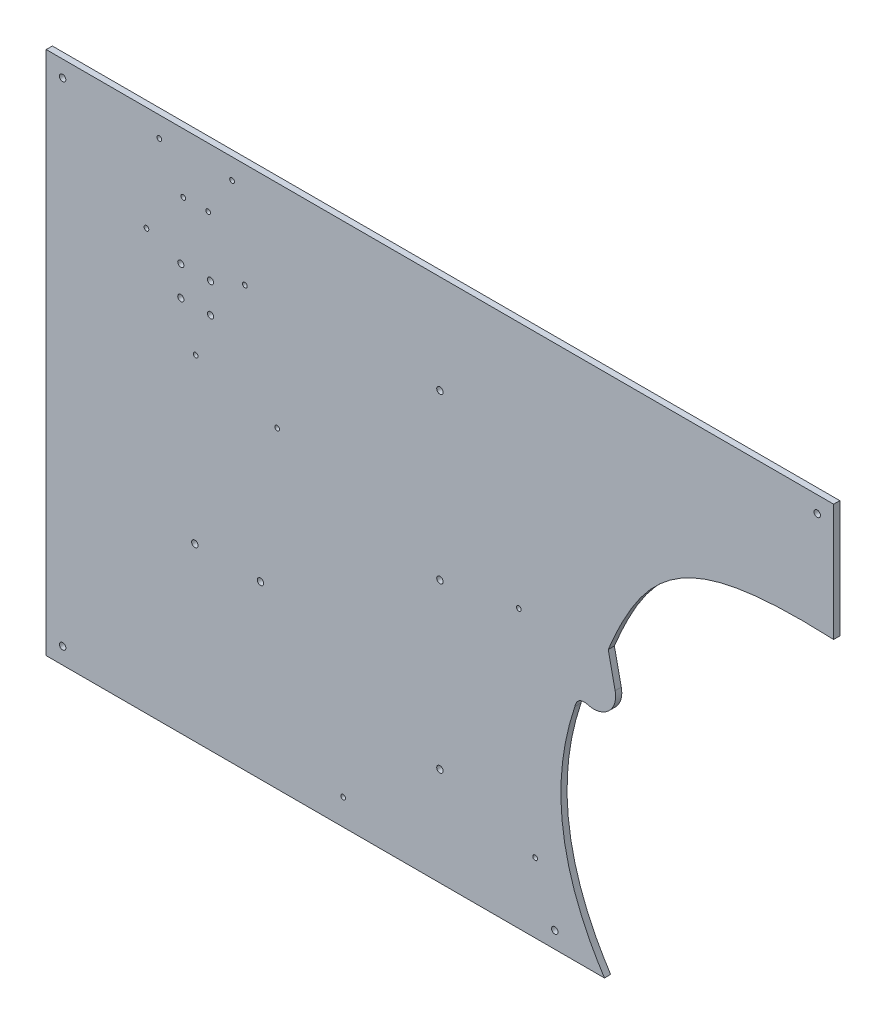
ISO-10303-21;
HEADER;
FILE_DESCRIPTION(('STEP AP214'),'2;1');
FILE_NAME('part.step','',(''),(''),'','','');
FILE_SCHEMA(('AUTOMOTIVE_DESIGN { 1 0 10303 214 1 1 1 1 }'));
ENDSEC;
DATA;
#1=APPLICATION_CONTEXT('core data for automotive mechanical design processes');
#2=APPLICATION_PROTOCOL_DEFINITION('international standard','automotive_design',2000,#1);
#3=PRODUCT_CONTEXT('',#1,'mechanical');
#4=PRODUCT('Part','Part','',(#3));
#5=PRODUCT_RELATED_PRODUCT_CATEGORY('part','',(#4));
#6=PRODUCT_DEFINITION_FORMATION('','',#4);
#7=PRODUCT_DEFINITION_CONTEXT('part definition',#1,'design');
#8=PRODUCT_DEFINITION('design','',#6,#7);
#9=PRODUCT_DEFINITION_SHAPE('','',#8);
#10=(LENGTH_UNIT() NAMED_UNIT(*) SI_UNIT(.MILLI.,.METRE.));
#11=(NAMED_UNIT(*) PLANE_ANGLE_UNIT() SI_UNIT($,.RADIAN.));
#12=(NAMED_UNIT(*) SI_UNIT($,.STERADIAN.) SOLID_ANGLE_UNIT());
#13=UNCERTAINTY_MEASURE_WITH_UNIT(LENGTH_MEASURE(1.E-05),#10,'distance_accuracy_value','');
#14=(GEOMETRIC_REPRESENTATION_CONTEXT(3) GLOBAL_UNCERTAINTY_ASSIGNED_CONTEXT((#13)) GLOBAL_UNIT_ASSIGNED_CONTEXT((#10,
#11,#12)) REPRESENTATION_CONTEXT('',''));
#15=CARTESIAN_POINT('',(0.,0.,0.));
#16=DIRECTION('',(0.,0.,1.));
#17=DIRECTION('',(1.,0.,0.));
#18=AXIS2_PLACEMENT_3D('',#15,#16,#17);
#19=CARTESIAN_POINT('',(0.,0.,4.7625));
#20=DIRECTION('',(0.,0.,-1.));
#21=DIRECTION('',(-1.,0.,0.));
#22=AXIS2_PLACEMENT_3D('',#19,#20,#21);
#23=PLANE('',#22);
#24=CARTESIAN_POINT('',(127.2,314.9,4.7625));
#25=DIRECTION('',(0.,0.,1.));
#26=DIRECTION('',(1.,0.,0.));
#27=AXIS2_PLACEMENT_3D('',#24,#25,#26);
#28=CIRCLE('',#27,2.38125);
#29=CARTESIAN_POINT('',(129.58125,314.9,4.7625));
#30=VERTEX_POINT('',#29);
#31=EDGE_CURVE('E490',#30,#30,#28,.T.);
#32=ORIENTED_EDGE('',*,*,#31,.F.);
#33=EDGE_LOOP('',(#32));
#34=FACE_BOUND('',#33,.T.);
#35=CARTESIAN_POINT('',(127.2,291.9,4.7625));
#36=DIRECTION('',(0.,0.,1.));
#37=DIRECTION('',(1.,0.,0.));
#38=AXIS2_PLACEMENT_3D('',#35,#36,#37);
#39=CIRCLE('',#38,2.38125);
#40=CARTESIAN_POINT('',(129.58125,291.9,4.7625));
#41=VERTEX_POINT('',#40);
#42=EDGE_CURVE('E494',#41,#41,#39,.T.);
#43=ORIENTED_EDGE('',*,*,#42,.F.);
#44=EDGE_LOOP('',(#43));
#45=FACE_BOUND('',#44,.T.);
#46=CARTESIAN_POINT('',(104.2,291.9,4.7625));
#47=DIRECTION('',(0.,0.,1.));
#48=DIRECTION('',(1.,0.,0.));
#49=AXIS2_PLACEMENT_3D('',#46,#47,#48);
#50=CIRCLE('',#49,2.38125);
#51=CARTESIAN_POINT('',(106.58125,291.9,4.7625));
#52=VERTEX_POINT('',#51);
#53=EDGE_CURVE('E504',#52,#52,#50,.T.);
#54=ORIENTED_EDGE('',*,*,#53,.F.);
#55=EDGE_LOOP('',(#54));
#56=FACE_BOUND('',#55,.T.);
#57=CARTESIAN_POINT('',(393.7,12.6999999999999,4.7625));
#58=DIRECTION('',(0.,0.,1.));
#59=DIRECTION('',(1.,0.,0.));
#60=AXIS2_PLACEMENT_3D('',#57,#58,#59);
#61=CIRCLE('',#60,2.48920000000002);
#62=CARTESIAN_POINT('',(396.1892,12.6999999999999,4.7625));
#63=VERTEX_POINT('',#62);
#64=EDGE_CURVE('E709',#63,#63,#61,.T.);
#65=ORIENTED_EDGE('',*,*,#64,.F.);
#66=EDGE_LOOP('',(#65));
#67=FACE_BOUND('',#66,.T.);
#68=CARTESIAN_POINT('',(304.8,76.2,4.7625));
#69=DIRECTION('',(0.,0.,1.));
#70=DIRECTION('',(1.,0.,0.));
#71=AXIS2_PLACEMENT_3D('',#68,#69,#70);
#72=CIRCLE('',#71,2.48920000000002);
#73=CARTESIAN_POINT('',(307.2892,76.2,4.7625));
#74=VERTEX_POINT('',#73);
#75=EDGE_CURVE('E701',#74,#74,#72,.T.);
#76=ORIENTED_EDGE('',*,*,#75,.F.);
#77=EDGE_LOOP('',(#76));
#78=FACE_BOUND('',#77,.T.);
#79=CARTESIAN_POINT('',(304.8,330.2,4.7625));
#80=DIRECTION('',(0.,0.,1.));
#81=DIRECTION('',(1.,0.,0.));
#82=AXIS2_PLACEMENT_3D('',#79,#80,#81);
#83=CIRCLE('',#82,2.48920000000002);
#84=CARTESIAN_POINT('',(307.2892,330.2,4.7625));
#85=VERTEX_POINT('',#84);
#86=EDGE_CURVE('E693',#85,#85,#83,.T.);
#87=ORIENTED_EDGE('',*,*,#86,.F.);
#88=EDGE_LOOP('',(#87));
#89=FACE_BOUND('',#88,.T.);
#90=CARTESIAN_POINT('',(12.7,393.7,4.7625));
#91=DIRECTION('',(0.,0.,1.));
#92=DIRECTION('',(1.,0.,0.));
#93=AXIS2_PLACEMENT_3D('',#90,#91,#92);
#94=CIRCLE('',#93,2.4892);
#95=CARTESIAN_POINT('',(15.1892,393.7,4.7625));
#96=VERTEX_POINT('',#95);
#97=EDGE_CURVE('E685',#96,#96,#94,.T.);
#98=ORIENTED_EDGE('',*,*,#97,.F.);
#99=EDGE_LOOP('',(#98));
#100=FACE_BOUND('',#99,.T.);
#101=CARTESIAN_POINT('',(12.7,12.6999999999999,4.7625));
#102=DIRECTION('',(0.,0.,1.));
#103=DIRECTION('',(1.,0.,0.));
#104=AXIS2_PLACEMENT_3D('',#101,#102,#103);
#105=CIRCLE('',#104,2.4892);
#106=CARTESIAN_POINT('',(15.1892,12.6999999999999,4.7625));
#107=VERTEX_POINT('',#106);
#108=EDGE_CURVE('E677',#107,#107,#105,.T.);
#109=ORIENTED_EDGE('',*,*,#108,.F.);
#110=EDGE_LOOP('',(#109));
#111=FACE_BOUND('',#110,.T.);
#112=CARTESIAN_POINT('',(596.9,393.7,4.7625));
#113=DIRECTION('',(0.,0.,1.));
#114=DIRECTION('',(1.,0.,0.));
#115=AXIS2_PLACEMENT_3D('',#112,#113,#114);
#116=CIRCLE('',#115,2.48919999999997);
#117=CARTESIAN_POINT('',(599.3892,393.7,4.7625));
#118=VERTEX_POINT('',#117);
#119=EDGE_CURVE('E669',#118,#118,#116,.T.);
#120=ORIENTED_EDGE('',*,*,#119,.F.);
#121=EDGE_LOOP('',(#120));
#122=FACE_BOUND('',#121,.T.);
#123=CARTESIAN_POINT('',(304.8,203.2,4.7625));
#124=DIRECTION('',(0.,0.,1.));
#125=DIRECTION('',(1.,0.,0.));
#126=AXIS2_PLACEMENT_3D('',#123,#124,#125);
#127=CIRCLE('',#126,2.48920000000002);
#128=CARTESIAN_POINT('',(307.2892,203.2,4.7625));
#129=VERTEX_POINT('',#128);
#130=EDGE_CURVE('E661',#129,#129,#127,.T.);
#131=ORIENTED_EDGE('',*,*,#130,.F.);
#132=EDGE_LOOP('',(#131));
#133=FACE_BOUND('',#132,.T.);
#134=CARTESIAN_POINT('',(143.888494197833,390.539377283686,4.7625));
#135=DIRECTION('',(0.,0.,1.));
#136=DIRECTION('',(1.,0.,0.));
#137=AXIS2_PLACEMENT_3D('',#134,#135,#136);
#138=CIRCLE('',#137,1.82879999999999);
#139=CARTESIAN_POINT('',(145.717294197833,390.539377283686,4.7625));
#140=VERTEX_POINT('',#139);
#141=EDGE_CURVE('E653',#140,#140,#138,.T.);
#142=ORIENTED_EDGE('',*,*,#141,.F.);
#143=EDGE_LOOP('',(#142));
#144=FACE_BOUND('',#143,.T.);
#145=CARTESIAN_POINT('',(125.352,360.365035488624,4.7625));
#146=DIRECTION('',(0.,0.,1.));
#147=DIRECTION('',(1.,0.,0.));
#148=AXIS2_PLACEMENT_3D('',#145,#146,#147);
#149=CIRCLE('',#148,1.82879999999999);
#150=CARTESIAN_POINT('',(127.1808,360.365035488624,4.7625));
#151=VERTEX_POINT('',#150);
#152=EDGE_CURVE('E645',#151,#151,#149,.T.);
#153=ORIENTED_EDGE('',*,*,#152,.F.);
#154=EDGE_LOOP('',(#153));
#155=FACE_BOUND('',#154,.T.);
#156=CARTESIAN_POINT('',(106.048,360.365035488624,4.7625));
#157=DIRECTION('',(0.,0.,1.));
#158=DIRECTION('',(1.,0.,0.));
#159=AXIS2_PLACEMENT_3D('',#156,#157,#158);
#160=CIRCLE('',#159,1.82879999999999);
#161=CARTESIAN_POINT('',(107.8768,360.365035488624,4.7625));
#162=VERTEX_POINT('',#161);
#163=EDGE_CURVE('E637',#162,#162,#160,.T.);
#164=ORIENTED_EDGE('',*,*,#163,.F.);
#165=EDGE_LOOP('',(#164));
#166=FACE_BOUND('',#165,.T.);
#167=CARTESIAN_POINT('',(87.5115058021667,390.539377283686,4.7625));
#168=DIRECTION('',(0.,0.,1.));
#169=DIRECTION('',(1.,0.,0.));
#170=AXIS2_PLACEMENT_3D('',#167,#168,#169);
#171=CIRCLE('',#170,1.82879999999999);
#172=CARTESIAN_POINT('',(89.3403058021667,390.539377283686,4.7625));
#173=VERTEX_POINT('',#172);
#174=EDGE_CURVE('E629',#173,#173,#171,.T.);
#175=ORIENTED_EDGE('',*,*,#174,.F.);
#176=EDGE_LOOP('',(#175));
#177=FACE_BOUND('',#176,.T.);
#178=CARTESIAN_POINT('',(229.881403773872,20.1310664578161,4.7625));
#179=DIRECTION('',(0.,0.,1.));
#180=DIRECTION('',(1.,0.,0.));
#181=AXIS2_PLACEMENT_3D('',#178,#179,#180);
#182=CIRCLE('',#181,1.82879999999999);
#183=CARTESIAN_POINT('',(231.710203773871,20.1310664578161,4.7625));
#184=VERTEX_POINT('',#183);
#185=EDGE_CURVE('E621',#184,#184,#182,.T.);
#186=ORIENTED_EDGE('',*,*,#185,.F.);
#187=EDGE_LOOP('',(#186));
#188=FACE_BOUND('',#187,.T.);
#189=CARTESIAN_POINT('',(378.514626903832,53.8048690645804,4.7625));
#190=DIRECTION('',(0.,0.,1.));
#191=DIRECTION('',(1.,0.,0.));
#192=AXIS2_PLACEMENT_3D('',#189,#190,#191);
#193=CIRCLE('',#192,1.82879999999996);
#194=CARTESIAN_POINT('',(380.343426903832,53.8048690645804,4.7625));
#195=VERTEX_POINT('',#194);
#196=EDGE_CURVE('E613',#195,#195,#193,.T.);
#197=ORIENTED_EDGE('',*,*,#196,.F.);
#198=EDGE_LOOP('',(#197));
#199=FACE_BOUND('',#198,.T.);
#200=CARTESIAN_POINT('',(365.913011093271,214.603454563994,4.7625));
#201=DIRECTION('',(0.,0.,1.));
#202=DIRECTION('',(1.,0.,0.));
#203=AXIS2_PLACEMENT_3D('',#200,#201,#202);
#204=CIRCLE('',#203,1.82879999999996);
#205=CARTESIAN_POINT('',(367.741811093271,214.603454563994,4.7625));
#206=VERTEX_POINT('',#205);
#207=EDGE_CURVE('E605',#206,#206,#204,.T.);
#208=ORIENTED_EDGE('',*,*,#207,.F.);
#209=EDGE_LOOP('',(#208));
#210=FACE_BOUND('',#209,.T.);
#211=CARTESIAN_POINT('',(178.748637136136,241.986495315083,4.7625));
#212=DIRECTION('',(0.,0.,1.));
#213=DIRECTION('',(1.,0.,0.));
#214=AXIS2_PLACEMENT_3D('',#211,#212,#213);
#215=CIRCLE('',#214,1.82879999999999);
#216=CARTESIAN_POINT('',(180.577437136136,241.986495315083,4.7625));
#217=VERTEX_POINT('',#216);
#218=EDGE_CURVE('E597',#217,#217,#215,.T.);
#219=ORIENTED_EDGE('',*,*,#218,.F.);
#220=EDGE_LOOP('',(#219));
#221=FACE_BOUND('',#220,.T.);
#222=CARTESIAN_POINT('',(77.6000000000001,325.397045256125,4.7625));
#223=DIRECTION('',(0.,0.,1.));
#224=DIRECTION('',(1.,0.,0.));
#225=AXIS2_PLACEMENT_3D('',#222,#223,#224);
#226=CIRCLE('',#225,1.82879999999999);
#227=CARTESIAN_POINT('',(79.4288000000001,325.397045256125,4.7625));
#228=VERTEX_POINT('',#227);
#229=EDGE_CURVE('E589',#228,#228,#226,.T.);
#230=ORIENTED_EDGE('',*,*,#229,.F.);
#231=EDGE_LOOP('',(#230));
#232=FACE_BOUND('',#231,.T.);
#233=CARTESIAN_POINT('',(115.7,259.40590948775,4.7625));
#234=DIRECTION('',(0.,0.,1.));
#235=DIRECTION('',(1.,0.,0.));
#236=AXIS2_PLACEMENT_3D('',#233,#234,#235);
#237=CIRCLE('',#236,1.82879999999999);
#238=CARTESIAN_POINT('',(117.5288,259.40590948775,4.7625));
#239=VERTEX_POINT('',#238);
#240=EDGE_CURVE('E581',#239,#239,#237,.T.);
#241=ORIENTED_EDGE('',*,*,#240,.F.);
#242=EDGE_LOOP('',(#241));
#243=FACE_BOUND('',#242,.T.);
#244=CARTESIAN_POINT('',(153.8,325.397045256125,4.7625));
#245=DIRECTION('',(0.,0.,1.));
#246=DIRECTION('',(1.,0.,0.));
#247=AXIS2_PLACEMENT_3D('',#244,#245,#246);
#248=CIRCLE('',#247,1.82879999999999);
#249=CARTESIAN_POINT('',(155.6288,325.397045256125,4.7625));
#250=VERTEX_POINT('',#249);
#251=EDGE_CURVE('E573',#250,#250,#248,.T.);
#252=ORIENTED_EDGE('',*,*,#251,.F.);
#253=EDGE_LOOP('',(#252));
#254=FACE_BOUND('',#253,.T.);
#255=CARTESIAN_POINT('',(115.09375,132.55625,4.7625));
#256=DIRECTION('',(0.,0.,1.));
#257=DIRECTION('',(1.,0.,0.));
#258=AXIS2_PLACEMENT_3D('',#255,#256,#257);
#259=CIRCLE('',#258,2.4892);
#260=CARTESIAN_POINT('',(117.58295,132.55625,4.7625));
#261=VERTEX_POINT('',#260);
#262=EDGE_CURVE('E565',#261,#261,#259,.T.);
#263=ORIENTED_EDGE('',*,*,#262,.F.);
#264=EDGE_LOOP('',(#263));
#265=FACE_BOUND('',#264,.T.);
#266=CARTESIAN_POINT('',(165.89375,132.55625,4.7625));
#267=DIRECTION('',(0.,0.,1.));
#268=DIRECTION('',(1.,0.,0.));
#269=AXIS2_PLACEMENT_3D('',#266,#267,#268);
#270=CIRCLE('',#269,2.4892);
#271=CARTESIAN_POINT('',(168.38295,132.55625,4.7625));
#272=VERTEX_POINT('',#271);
#273=EDGE_CURVE('E141',#272,#272,#270,.T.);
#274=ORIENTED_EDGE('',*,*,#273,.F.);
#275=EDGE_LOOP('',(#274));
#276=FACE_BOUND('',#275,.T.);
#277=CARTESIAN_POINT('',(609.6,315.642514432746,4.7625));
#278=CARTESIAN_POINT('',(498.032190496661,320.641169760965,4.7625));
#279=CARTESIAN_POINT('',(465.243862883186,294.790369183296,4.7625));
#280=CARTESIAN_POINT('',(435.086955617096,221.682561202754,4.7625));
#281=B_SPLINE_CURVE_WITH_KNOTS('',3,(#277,#278,#279,#280),.UNSPECIFIED.,.F.,.F.,(4,4),
(0.107898543959813,1.),.UNSPECIFIED.);
#282=CARTESIAN_POINT('',(609.6,315.642514432746,4.7625));
#283=VERTEX_POINT('',#282);
#284=CARTESIAN_POINT('',(435.086955617096,221.682561202754,4.7625));
#285=VERTEX_POINT('',#284);
#286=EDGE_CURVE('E122',#283,#285,#281,.T.);
#287=ORIENTED_EDGE('',*,*,#286,.F.);
#288=DIRECTION('',(0.,1.,0.));
#289=VECTOR('',#288,1.);
#290=CARTESIAN_POINT('',(609.6,0.,4.7625));
#291=LINE('',#290,#289);
#292=CARTESIAN_POINT('',(609.6,406.4,4.7625));
#293=VERTEX_POINT('',#292);
#294=EDGE_CURVE('E294',#283,#293,#291,.T.);
#295=ORIENTED_EDGE('',*,*,#294,.T.);
#296=DIRECTION('',(-1.,0.,0.));
#297=VECTOR('',#296,1.);
#298=CARTESIAN_POINT('',(0.,406.4,4.7625));
#299=LINE('',#298,#297);
#300=CARTESIAN_POINT('',(0.,406.4,4.7625));
#301=VERTEX_POINT('',#300);
#302=EDGE_CURVE('E65',#293,#301,#299,.T.);
#303=ORIENTED_EDGE('',*,*,#302,.T.);
#304=DIRECTION('',(0.,-1.,0.));
#305=VECTOR('',#304,1.);
#306=CARTESIAN_POINT('',(0.,0.,4.7625));
#307=LINE('',#306,#305);
#308=CARTESIAN_POINT('',(0.,0.,4.7625));
#309=VERTEX_POINT('',#308);
#310=EDGE_CURVE('E291',#301,#309,#307,.T.);
#311=ORIENTED_EDGE('',*,*,#310,.T.);
#312=DIRECTION('',(1.,0.,0.));
#313=VECTOR('',#312,1.);
#314=CARTESIAN_POINT('',(0.,0.,4.7625));
#315=LINE('',#314,#313);
#316=CARTESIAN_POINT('',(432.195867806559,0.,4.7625));
#317=VERTEX_POINT('',#316);
#318=EDGE_CURVE('E87',#309,#317,#315,.T.);
#319=ORIENTED_EDGE('',*,*,#318,.T.);
#320=CARTESIAN_POINT('',(409.296591519606,170.61794466171,4.7625));
#321=CARTESIAN_POINT('',(389.336707443308,111.226571113746,4.7625));
#322=CARTESIAN_POINT('',(396.969802789697,54.3539325629976,4.7625));
#323=CARTESIAN_POINT('',(432.195867806559,0.,4.7625));
#324=B_SPLINE_CURVE_WITH_KNOTS('',3,(#320,#321,#322,#323),.UNSPECIFIED.,.F.,.F.,(4,4),
(0.116936562328536,1.),.UNSPECIFIED.);
#325=CARTESIAN_POINT('',(409.296591519606,170.61794466171,4.7625));
#326=VERTEX_POINT('',#325);
#327=EDGE_CURVE('E163',#326,#317,#324,.T.);
#328=ORIENTED_EDGE('',*,*,#327,.F.);
#329=CARTESIAN_POINT('',(418.072340830066,177.130573080057,4.7625));
#330=CARTESIAN_POINT('',(410.929678592085,177.953538089177,4.7625));
#331=CARTESIAN_POINT('',(409.296591519606,170.61794466171,4.7625));
#332=B_SPLINE_CURVE_WITH_KNOTS('',2,(#329,#330,#331),.UNSPECIFIED.,.F.,.F.,(3,3),(0.,1.),.UNSPECIFIED.);
#333=CARTESIAN_POINT('',(418.072340830066,177.130573080057,4.7625));
#334=VERTEX_POINT('',#333);
#335=EDGE_CURVE('E151',#334,#326,#332,.T.);
#336=ORIENTED_EDGE('',*,*,#335,.F.);
#337=CARTESIAN_POINT('',(423.814311885952,193.160662855654,4.7625));
#338=DIRECTION('',(0.,0.,-1.));
#339=DIRECTION('',(1.,0.,0.));
#340=AXIS2_PLACEMENT_3D('',#337,#338,#339);
#341=CIRCLE('',#340,17.0274487173011);
#342=CARTESIAN_POINT('',(440.45974613986,196.747238983264,4.7625));
#343=VERTEX_POINT('',#342);
#344=EDGE_CURVE('E147',#343,#334,#341,.T.);
#345=ORIENTED_EDGE('',*,*,#344,.F.);
#346=DIRECTION('',(0.210634968700039,-0.977564785556811,0.));
#347=VECTOR('',#346,1.);
#348=CARTESIAN_POINT('',(440.45974613986,196.747238983264,4.7625));
#349=LINE('',#348,#347);
#350=EDGE_CURVE('E132',#285,#343,#349,.T.);
#351=ORIENTED_EDGE('',*,*,#350,.F.);
#352=EDGE_LOOP('',(#287,#295,#303,#311,#319,#328,#336,#345,#351));
#353=FACE_BOUND('',#352,.T.);
#354=CARTESIAN_POINT('',(104.2,314.9,4.7625));
#355=DIRECTION('',(0.,0.,1.));
#356=DIRECTION('',(1.,0.,0.));
#357=AXIS2_PLACEMENT_3D('',#354,#355,#356);
#358=CIRCLE('',#357,2.38125);
#359=CARTESIAN_POINT('',(106.58125,314.9,4.7625));
#360=VERTEX_POINT('',#359);
#361=EDGE_CURVE('E512',#360,#360,#358,.T.);
#362=ORIENTED_EDGE('',*,*,#361,.F.);
#363=EDGE_LOOP('',(#362));
#364=FACE_BOUND('',#363,.T.);
#365=ADVANCED_FACE('F40',(#34,#45,#56,#67,#78,#89,#100,#111,#122,#133,#144,#155,#166,#177,#188,
#199,#210,#221,#232,#243,#254,#265,#276,#353,#364),#23,.F.);
#366=CARTESIAN_POINT('',(0.,0.,4.7625));
#367=DIRECTION('',(0.,1.,0.));
#368=DIRECTION('',(0.,0.,1.));
#369=AXIS2_PLACEMENT_3D('',#366,#367,#368);
#370=PLANE('',#369);
#371=DIRECTION('',(0.,0.,-1.));
#372=VECTOR('',#371,1.);
#373=CARTESIAN_POINT('',(432.195867806559,0.,4.7625));
#374=LINE('',#373,#372);
#375=CARTESIAN_POINT('',(432.195867806559,0.,0.));
#376=VERTEX_POINT('',#375);
#377=EDGE_CURVE('E56',#317,#376,#374,.T.);
#378=ORIENTED_EDGE('',*,*,#377,.F.);
#379=ORIENTED_EDGE('',*,*,#318,.F.);
#380=DIRECTION('',(0.,0.,-1.));
#381=VECTOR('',#380,1.);
#382=CARTESIAN_POINT('',(0.,0.,4.7625));
#383=LINE('',#382,#381);
#384=CARTESIAN_POINT('',(0.,0.,0.));
#385=VERTEX_POINT('',#384);
#386=EDGE_CURVE('E11',#309,#385,#383,.T.);
#387=ORIENTED_EDGE('',*,*,#386,.T.);
#388=DIRECTION('',(1.,0.,0.));
#389=VECTOR('',#388,1.);
#390=CARTESIAN_POINT('',(0.,0.,0.));
#391=LINE('',#390,#389);
#392=EDGE_CURVE('E285',#385,#376,#391,.T.);
#393=ORIENTED_EDGE('',*,*,#392,.T.);
#394=EDGE_LOOP('',(#378,#379,#387,#393));
#395=FACE_BOUND('',#394,.T.);
#396=ADVANCED_FACE('F270',(#395),#370,.F.);
#397=CARTESIAN_POINT('',(609.6,0.,4.7625));
#398=DIRECTION('',(-1.,0.,0.));
#399=DIRECTION('',(0.,0.,1.));
#400=AXIS2_PLACEMENT_3D('',#397,#398,#399);
#401=PLANE('',#400);
#402=DIRECTION('',(0.,0.,-1.));
#403=VECTOR('',#402,1.);
#404=CARTESIAN_POINT('',(609.6,315.642514432746,4.7625));
#405=LINE('',#404,#403);
#406=CARTESIAN_POINT('',(609.6,315.642514432746,0.));
#407=VERTEX_POINT('',#406);
#408=EDGE_CURVE('E128',#283,#407,#405,.T.);
#409=ORIENTED_EDGE('',*,*,#408,.T.);
#410=DIRECTION('',(0.,1.,0.));
#411=VECTOR('',#410,1.);
#412=CARTESIAN_POINT('',(609.6,0.,0.));
#413=LINE('',#412,#411);
#414=CARTESIAN_POINT('',(609.6,406.4,0.));
#415=VERTEX_POINT('',#414);
#416=EDGE_CURVE('E312',#407,#415,#413,.T.);
#417=ORIENTED_EDGE('',*,*,#416,.T.);
#418=DIRECTION('',(0.,0.,-1.));
#419=VECTOR('',#418,1.);
#420=CARTESIAN_POINT('',(609.6,406.4,4.7625));
#421=LINE('',#420,#419);
#422=EDGE_CURVE('E49',#293,#415,#421,.T.);
#423=ORIENTED_EDGE('',*,*,#422,.F.);
#424=ORIENTED_EDGE('',*,*,#294,.F.);
#425=EDGE_LOOP('',(#409,#417,#423,#424));
#426=FACE_BOUND('',#425,.T.);
#427=ADVANCED_FACE('F275',(#426),#401,.F.);
#428=CARTESIAN_POINT('',(0.,0.,0.));
#429=DIRECTION('',(0.,0.,-1.));
#430=DIRECTION('',(-1.,0.,0.));
#431=AXIS2_PLACEMENT_3D('',#428,#429,#430);
#432=PLANE('',#431);
#433=CARTESIAN_POINT('',(127.2,314.9,0.));
#434=DIRECTION('',(0.,0.,-1.));
#435=DIRECTION('',(-1.,0.,0.));
#436=AXIS2_PLACEMENT_3D('',#433,#434,#435);
#437=CIRCLE('',#436,2.38125);
#438=CARTESIAN_POINT('',(124.81875,314.9,0.));
#439=VERTEX_POINT('',#438);
#440=EDGE_CURVE('E487',#439,#439,#437,.T.);
#441=ORIENTED_EDGE('',*,*,#440,.F.);
#442=EDGE_LOOP('',(#441));
#443=FACE_BOUND('',#442,.T.);
#444=CARTESIAN_POINT('',(127.2,291.9,0.));
#445=DIRECTION('',(0.,0.,-1.));
#446=DIRECTION('',(-1.,0.,0.));
#447=AXIS2_PLACEMENT_3D('',#444,#445,#446);
#448=CIRCLE('',#447,2.38125);
#449=CARTESIAN_POINT('',(124.81875,291.9,0.));
#450=VERTEX_POINT('',#449);
#451=EDGE_CURVE('E500',#450,#450,#448,.T.);
#452=ORIENTED_EDGE('',*,*,#451,.F.);
#453=EDGE_LOOP('',(#452));
#454=FACE_BOUND('',#453,.T.);
#455=CARTESIAN_POINT('',(104.2,291.9,0.));
#456=DIRECTION('',(0.,0.,-1.));
#457=DIRECTION('',(-1.,0.,0.));
#458=AXIS2_PLACEMENT_3D('',#455,#456,#457);
#459=CIRCLE('',#458,2.38125);
#460=CARTESIAN_POINT('',(101.81875,291.9,0.));
#461=VERTEX_POINT('',#460);
#462=EDGE_CURVE('E508',#461,#461,#459,.T.);
#463=ORIENTED_EDGE('',*,*,#462,.F.);
#464=EDGE_LOOP('',(#463));
#465=FACE_BOUND('',#464,.T.);
#466=CARTESIAN_POINT('',(104.2,314.9,0.));
#467=DIRECTION('',(0.,0.,-1.));
#468=DIRECTION('',(-1.,0.,0.));
#469=AXIS2_PLACEMENT_3D('',#466,#467,#468);
#470=CIRCLE('',#469,2.38125);
#471=CARTESIAN_POINT('',(101.81875,314.9,0.));
#472=VERTEX_POINT('',#471);
#473=EDGE_CURVE('E515',#472,#472,#470,.T.);
#474=ORIENTED_EDGE('',*,*,#473,.F.);
#475=EDGE_LOOP('',(#474));
#476=FACE_BOUND('',#475,.T.);
#477=CARTESIAN_POINT('',(393.7,12.6999999999999,0.));
#478=DIRECTION('',(0.,0.,-1.));
#479=DIRECTION('',(-1.,0.,0.));
#480=AXIS2_PLACEMENT_3D('',#477,#478,#479);
#481=CIRCLE('',#480,2.48920000000002);
#482=CARTESIAN_POINT('',(391.2108,12.6999999999999,0.));
#483=VERTEX_POINT('',#482);
#484=EDGE_CURVE('E309',#483,#483,#481,.T.);
#485=ORIENTED_EDGE('',*,*,#484,.F.);
#486=EDGE_LOOP('',(#485));
#487=FACE_BOUND('',#486,.T.);
#488=CARTESIAN_POINT('',(304.8,76.2,0.));
#489=DIRECTION('',(0.,0.,-1.));
#490=DIRECTION('',(-1.,0.,0.));
#491=AXIS2_PLACEMENT_3D('',#488,#489,#490);
#492=CIRCLE('',#491,2.48920000000002);
#493=CARTESIAN_POINT('',(302.3108,76.2,0.));
#494=VERTEX_POINT('',#493);
#495=EDGE_CURVE('E705',#494,#494,#492,.T.);
#496=ORIENTED_EDGE('',*,*,#495,.F.);
#497=EDGE_LOOP('',(#496));
#498=FACE_BOUND('',#497,.T.);
#499=CARTESIAN_POINT('',(304.8,330.2,0.));
#500=DIRECTION('',(0.,0.,-1.));
#501=DIRECTION('',(-1.,0.,0.));
#502=AXIS2_PLACEMENT_3D('',#499,#500,#501);
#503=CIRCLE('',#502,2.48920000000002);
#504=CARTESIAN_POINT('',(302.3108,330.2,0.));
#505=VERTEX_POINT('',#504);
#506=EDGE_CURVE('E697',#505,#505,#503,.T.);
#507=ORIENTED_EDGE('',*,*,#506,.F.);
#508=EDGE_LOOP('',(#507));
#509=FACE_BOUND('',#508,.T.);
#510=CARTESIAN_POINT('',(12.7,393.7,0.));
#511=DIRECTION('',(0.,0.,-1.));
#512=DIRECTION('',(-1.,0.,0.));
#513=AXIS2_PLACEMENT_3D('',#510,#511,#512);
#514=CIRCLE('',#513,2.4892);
#515=CARTESIAN_POINT('',(10.2108,393.7,0.));
#516=VERTEX_POINT('',#515);
#517=EDGE_CURVE('E689',#516,#516,#514,.T.);
#518=ORIENTED_EDGE('',*,*,#517,.F.);
#519=EDGE_LOOP('',(#518));
#520=FACE_BOUND('',#519,.T.);
#521=CARTESIAN_POINT('',(12.7,12.6999999999999,0.));
#522=DIRECTION('',(0.,0.,-1.));
#523=DIRECTION('',(-1.,0.,0.));
#524=AXIS2_PLACEMENT_3D('',#521,#522,#523);
#525=CIRCLE('',#524,2.4892);
#526=CARTESIAN_POINT('',(10.2108,12.6999999999999,0.));
#527=VERTEX_POINT('',#526);
#528=EDGE_CURVE('E681',#527,#527,#525,.T.);
#529=ORIENTED_EDGE('',*,*,#528,.F.);
#530=EDGE_LOOP('',(#529));
#531=FACE_BOUND('',#530,.T.);
#532=CARTESIAN_POINT('',(596.9,393.7,0.));
#533=DIRECTION('',(0.,0.,-1.));
#534=DIRECTION('',(-1.,0.,0.));
#535=AXIS2_PLACEMENT_3D('',#532,#533,#534);
#536=CIRCLE('',#535,2.48919999999997);
#537=CARTESIAN_POINT('',(594.4108,393.7,0.));
#538=VERTEX_POINT('',#537);
#539=EDGE_CURVE('E673',#538,#538,#536,.T.);
#540=ORIENTED_EDGE('',*,*,#539,.F.);
#541=EDGE_LOOP('',(#540));
#542=FACE_BOUND('',#541,.T.);
#543=CARTESIAN_POINT('',(304.8,203.2,0.));
#544=DIRECTION('',(0.,0.,-1.));
#545=DIRECTION('',(-1.,0.,0.));
#546=AXIS2_PLACEMENT_3D('',#543,#544,#545);
#547=CIRCLE('',#546,2.48920000000002);
#548=CARTESIAN_POINT('',(302.3108,203.2,0.));
#549=VERTEX_POINT('',#548);
#550=EDGE_CURVE('E665',#549,#549,#547,.T.);
#551=ORIENTED_EDGE('',*,*,#550,.F.);
#552=EDGE_LOOP('',(#551));
#553=FACE_BOUND('',#552,.T.);
#554=CARTESIAN_POINT('',(143.888494197833,390.539377283686,0.));
#555=DIRECTION('',(0.,0.,-1.));
#556=DIRECTION('',(-1.,0.,0.));
#557=AXIS2_PLACEMENT_3D('',#554,#555,#556);
#558=CIRCLE('',#557,1.82879999999999);
#559=CARTESIAN_POINT('',(142.059694197833,390.539377283686,0.));
#560=VERTEX_POINT('',#559);
#561=EDGE_CURVE('E657',#560,#560,#558,.T.);
#562=ORIENTED_EDGE('',*,*,#561,.F.);
#563=EDGE_LOOP('',(#562));
#564=FACE_BOUND('',#563,.T.);
#565=CARTESIAN_POINT('',(125.352,360.365035488624,0.));
#566=DIRECTION('',(0.,0.,-1.));
#567=DIRECTION('',(-1.,0.,0.));
#568=AXIS2_PLACEMENT_3D('',#565,#566,#567);
#569=CIRCLE('',#568,1.82879999999999);
#570=CARTESIAN_POINT('',(123.5232,360.365035488624,0.));
#571=VERTEX_POINT('',#570);
#572=EDGE_CURVE('E649',#571,#571,#569,.T.);
#573=ORIENTED_EDGE('',*,*,#572,.F.);
#574=EDGE_LOOP('',(#573));
#575=FACE_BOUND('',#574,.T.);
#576=CARTESIAN_POINT('',(106.048,360.365035488624,0.));
#577=DIRECTION('',(0.,0.,-1.));
#578=DIRECTION('',(-1.,0.,0.));
#579=AXIS2_PLACEMENT_3D('',#576,#577,#578);
#580=CIRCLE('',#579,1.82879999999999);
#581=CARTESIAN_POINT('',(104.2192,360.365035488624,0.));
#582=VERTEX_POINT('',#581);
#583=EDGE_CURVE('E641',#582,#582,#580,.T.);
#584=ORIENTED_EDGE('',*,*,#583,.F.);
#585=EDGE_LOOP('',(#584));
#586=FACE_BOUND('',#585,.T.);
#587=CARTESIAN_POINT('',(87.5115058021667,390.539377283686,0.));
#588=DIRECTION('',(0.,0.,-1.));
#589=DIRECTION('',(-1.,0.,0.));
#590=AXIS2_PLACEMENT_3D('',#587,#588,#589);
#591=CIRCLE('',#590,1.82879999999999);
#592=CARTESIAN_POINT('',(85.6827058021667,390.539377283686,0.));
#593=VERTEX_POINT('',#592);
#594=EDGE_CURVE('E633',#593,#593,#591,.T.);
#595=ORIENTED_EDGE('',*,*,#594,.F.);
#596=EDGE_LOOP('',(#595));
#597=FACE_BOUND('',#596,.T.);
#598=CARTESIAN_POINT('',(229.881403773872,20.1310664578161,0.));
#599=DIRECTION('',(0.,0.,-1.));
#600=DIRECTION('',(-1.,0.,0.));
#601=AXIS2_PLACEMENT_3D('',#598,#599,#600);
#602=CIRCLE('',#601,1.82879999999999);
#603=CARTESIAN_POINT('',(228.052603773872,20.1310664578161,0.));
#604=VERTEX_POINT('',#603);
#605=EDGE_CURVE('E625',#604,#604,#602,.T.);
#606=ORIENTED_EDGE('',*,*,#605,.F.);
#607=EDGE_LOOP('',(#606));
#608=FACE_BOUND('',#607,.T.);
#609=CARTESIAN_POINT('',(378.514626903832,53.8048690645804,0.));
#610=DIRECTION('',(0.,0.,-1.));
#611=DIRECTION('',(-1.,0.,0.));
#612=AXIS2_PLACEMENT_3D('',#609,#610,#611);
#613=CIRCLE('',#612,1.82879999999996);
#614=CARTESIAN_POINT('',(376.685826903832,53.8048690645804,0.));
#615=VERTEX_POINT('',#614);
#616=EDGE_CURVE('E617',#615,#615,#613,.T.);
#617=ORIENTED_EDGE('',*,*,#616,.F.);
#618=EDGE_LOOP('',(#617));
#619=FACE_BOUND('',#618,.T.);
#620=CARTESIAN_POINT('',(365.913011093271,214.603454563994,0.));
#621=DIRECTION('',(0.,0.,-1.));
#622=DIRECTION('',(-1.,0.,0.));
#623=AXIS2_PLACEMENT_3D('',#620,#621,#622);
#624=CIRCLE('',#623,1.82879999999996);
#625=CARTESIAN_POINT('',(364.084211093271,214.603454563994,0.));
#626=VERTEX_POINT('',#625);
#627=EDGE_CURVE('E609',#626,#626,#624,.T.);
#628=ORIENTED_EDGE('',*,*,#627,.F.);
#629=EDGE_LOOP('',(#628));
#630=FACE_BOUND('',#629,.T.);
#631=CARTESIAN_POINT('',(178.748637136136,241.986495315083,0.));
#632=DIRECTION('',(0.,0.,-1.));
#633=DIRECTION('',(-1.,0.,0.));
#634=AXIS2_PLACEMENT_3D('',#631,#632,#633);
#635=CIRCLE('',#634,1.82879999999999);
#636=CARTESIAN_POINT('',(176.919837136136,241.986495315083,0.));
#637=VERTEX_POINT('',#636);
#638=EDGE_CURVE('E601',#637,#637,#635,.T.);
#639=ORIENTED_EDGE('',*,*,#638,.F.);
#640=EDGE_LOOP('',(#639));
#641=FACE_BOUND('',#640,.T.);
#642=CARTESIAN_POINT('',(77.6000000000001,325.397045256125,0.));
#643=DIRECTION('',(0.,0.,-1.));
#644=DIRECTION('',(-1.,0.,0.));
#645=AXIS2_PLACEMENT_3D('',#642,#643,#644);
#646=CIRCLE('',#645,1.82879999999999);
#647=CARTESIAN_POINT('',(75.7712000000001,325.397045256125,0.));
#648=VERTEX_POINT('',#647);
#649=EDGE_CURVE('E593',#648,#648,#646,.T.);
#650=ORIENTED_EDGE('',*,*,#649,.F.);
#651=EDGE_LOOP('',(#650));
#652=FACE_BOUND('',#651,.T.);
#653=CARTESIAN_POINT('',(115.7,259.40590948775,0.));
#654=DIRECTION('',(0.,0.,-1.));
#655=DIRECTION('',(-1.,0.,0.));
#656=AXIS2_PLACEMENT_3D('',#653,#654,#655);
#657=CIRCLE('',#656,1.82879999999999);
#658=CARTESIAN_POINT('',(113.8712,259.40590948775,0.));
#659=VERTEX_POINT('',#658);
#660=EDGE_CURVE('E585',#659,#659,#657,.T.);
#661=ORIENTED_EDGE('',*,*,#660,.F.);
#662=EDGE_LOOP('',(#661));
#663=FACE_BOUND('',#662,.T.);
#664=CARTESIAN_POINT('',(153.8,325.397045256125,0.));
#665=DIRECTION('',(0.,0.,-1.));
#666=DIRECTION('',(-1.,0.,0.));
#667=AXIS2_PLACEMENT_3D('',#664,#665,#666);
#668=CIRCLE('',#667,1.82879999999999);
#669=CARTESIAN_POINT('',(151.9712,325.397045256125,0.));
#670=VERTEX_POINT('',#669);
#671=EDGE_CURVE('E577',#670,#670,#668,.T.);
#672=ORIENTED_EDGE('',*,*,#671,.F.);
#673=EDGE_LOOP('',(#672));
#674=FACE_BOUND('',#673,.T.);
#675=CARTESIAN_POINT('',(115.09375,132.55625,0.));
#676=DIRECTION('',(0.,0.,-1.));
#677=DIRECTION('',(-1.,0.,0.));
#678=AXIS2_PLACEMENT_3D('',#675,#676,#677);
#679=CIRCLE('',#678,2.4892);
#680=CARTESIAN_POINT('',(112.60455,132.55625,0.));
#681=VERTEX_POINT('',#680);
#682=EDGE_CURVE('E569',#681,#681,#679,.T.);
#683=ORIENTED_EDGE('',*,*,#682,.F.);
#684=EDGE_LOOP('',(#683));
#685=FACE_BOUND('',#684,.T.);
#686=CARTESIAN_POINT('',(165.89375,132.55625,0.));
#687=DIRECTION('',(0.,0.,-1.));
#688=DIRECTION('',(-1.,0.,0.));
#689=AXIS2_PLACEMENT_3D('',#686,#687,#688);
#690=CIRCLE('',#689,2.4892);
#691=CARTESIAN_POINT('',(163.40455,132.55625,0.));
#692=VERTEX_POINT('',#691);
#693=EDGE_CURVE('E561',#692,#692,#690,.T.);
#694=ORIENTED_EDGE('',*,*,#693,.F.);
#695=EDGE_LOOP('',(#694));
#696=FACE_BOUND('',#695,.T.);
#697=ORIENTED_EDGE('',*,*,#416,.F.);
#698=CARTESIAN_POINT('',(609.6,315.642514432746,0.));
#699=CARTESIAN_POINT('',(498.032190496661,320.641169760965,0.));
#700=CARTESIAN_POINT('',(465.243862883186,294.790369183296,0.));
#701=CARTESIAN_POINT('',(435.086955617096,221.682561202754,0.));
#702=B_SPLINE_CURVE_WITH_KNOTS('',3,(#698,#699,#700,#701),.UNSPECIFIED.,.F.,.F.,(4,4),
(0.107898543959813,1.),.UNSPECIFIED.);
#703=CARTESIAN_POINT('',(435.086955617096,221.682561202754,0.));
#704=VERTEX_POINT('',#703);
#705=EDGE_CURVE('E518',#407,#704,#702,.T.);
#706=ORIENTED_EDGE('',*,*,#705,.T.);
#707=DIRECTION('',(0.210634968700039,-0.977564785556811,0.));
#708=VECTOR('',#707,1.);
#709=CARTESIAN_POINT('',(440.45974613986,196.747238983264,0.));
#710=LINE('',#709,#708);
#711=CARTESIAN_POINT('',(440.45974613986,196.747238983264,0.));
#712=VERTEX_POINT('',#711);
#713=EDGE_CURVE('E139',#704,#712,#710,.T.);
#714=ORIENTED_EDGE('',*,*,#713,.T.);
#715=CARTESIAN_POINT('',(423.814311885952,193.160662855654,0.));
#716=DIRECTION('',(0.,0.,-1.));
#717=DIRECTION('',(1.,0.,0.));
#718=AXIS2_PLACEMENT_3D('',#715,#716,#717);
#719=CIRCLE('',#718,17.0274487173011);
#720=CARTESIAN_POINT('',(418.072340830066,177.130573080057,0.));
#721=VERTEX_POINT('',#720);
#722=EDGE_CURVE('E522',#712,#721,#719,.T.);
#723=ORIENTED_EDGE('',*,*,#722,.T.);
#724=CARTESIAN_POINT('',(418.072340830066,177.130573080057,0.));
#725=CARTESIAN_POINT('',(410.929678592085,177.953538089177,0.));
#726=CARTESIAN_POINT('',(409.296591519606,170.61794466171,0.));
#727=B_SPLINE_CURVE_WITH_KNOTS('',2,(#724,#725,#726),.UNSPECIFIED.,.F.,.F.,(3,3),(0.,1.),.UNSPECIFIED.);
#728=CARTESIAN_POINT('',(409.296591519606,170.61794466171,0.));
#729=VERTEX_POINT('',#728);
#730=EDGE_CURVE('E533',#721,#729,#727,.T.);
#731=ORIENTED_EDGE('',*,*,#730,.T.);
#732=CARTESIAN_POINT('',(409.296591519606,170.61794466171,0.));
#733=CARTESIAN_POINT('',(389.336707443308,111.226571113746,0.));
#734=CARTESIAN_POINT('',(396.969802789697,54.3539325629976,0.));
#735=CARTESIAN_POINT('',(432.195867806559,0.,0.));
#736=B_SPLINE_CURVE_WITH_KNOTS('',3,(#732,#733,#734,#735),.UNSPECIFIED.,.F.,.F.,(4,4),
(0.116936562328536,1.),.UNSPECIFIED.);
#737=EDGE_CURVE('E133',#729,#376,#736,.T.);
#738=ORIENTED_EDGE('',*,*,#737,.T.);
#739=ORIENTED_EDGE('',*,*,#392,.F.);
#740=DIRECTION('',(0.,-1.,0.));
#741=VECTOR('',#740,1.);
#742=CARTESIAN_POINT('',(0.,0.,0.));
#743=LINE('',#742,#741);
#744=CARTESIAN_POINT('',(0.,406.4,0.));
#745=VERTEX_POINT('',#744);
#746=EDGE_CURVE('E305',#745,#385,#743,.T.);
#747=ORIENTED_EDGE('',*,*,#746,.F.);
#748=DIRECTION('',(-1.,0.,0.));
#749=VECTOR('',#748,1.);
#750=CARTESIAN_POINT('',(0.,406.4,0.));
#751=LINE('',#750,#749);
#752=EDGE_CURVE('E82',#415,#745,#751,.T.);
#753=ORIENTED_EDGE('',*,*,#752,.F.);
#754=EDGE_LOOP('',(#697,#706,#714,#723,#731,#738,#739,#747,#753));
#755=FACE_BOUND('',#754,.T.);
#756=ADVANCED_FACE('F272',(#443,#454,#465,#476,#487,#498,#509,#520,#531,#542,#553,#564,#575,
#586,#597,#608,#619,#630,#641,#652,#663,#674,#685,#696,#755),#432,.T.);
#757=CARTESIAN_POINT('',(0.,0.,4.7625));
#758=DIRECTION('',(1.,0.,0.));
#759=DIRECTION('',(0.,0.,-1.));
#760=AXIS2_PLACEMENT_3D('',#757,#758,#759);
#761=PLANE('',#760);
#762=ORIENTED_EDGE('',*,*,#746,.T.);
#763=ORIENTED_EDGE('',*,*,#386,.F.);
#764=ORIENTED_EDGE('',*,*,#310,.F.);
#765=DIRECTION('',(0.,0.,-1.));
#766=VECTOR('',#765,1.);
#767=CARTESIAN_POINT('',(0.,406.4,4.7625));
#768=LINE('',#767,#766);
#769=EDGE_CURVE('E304',#301,#745,#768,.T.);
#770=ORIENTED_EDGE('',*,*,#769,.T.);
#771=EDGE_LOOP('',(#762,#763,#764,#770));
#772=FACE_BOUND('',#771,.T.);
#773=ADVANCED_FACE('F42',(#772),#761,.F.);
#774=CARTESIAN_POINT('',(0.,406.4,4.7625));
#775=DIRECTION('',(0.,-1.,0.));
#776=DIRECTION('',(0.,0.,-1.));
#777=AXIS2_PLACEMENT_3D('',#774,#775,#776);
#778=PLANE('',#777);
#779=ORIENTED_EDGE('',*,*,#752,.T.);
#780=ORIENTED_EDGE('',*,*,#769,.F.);
#781=ORIENTED_EDGE('',*,*,#302,.F.);
#782=ORIENTED_EDGE('',*,*,#422,.T.);
#783=EDGE_LOOP('',(#779,#780,#781,#782));
#784=FACE_BOUND('',#783,.T.);
#785=ADVANCED_FACE('F266',(#784),#778,.F.);
#786=CARTESIAN_POINT('',(393.7,12.6999999999999,4.7625));
#787=DIRECTION('',(0.,0.,1.));
#788=DIRECTION('',(1.,0.,0.));
#789=AXIS2_PLACEMENT_3D('',#786,#787,#788);
#790=CYLINDRICAL_SURFACE('',#789,2.48920000000002);
#791=ORIENTED_EDGE('',*,*,#484,.T.);
#792=EDGE_LOOP('',(#791));
#793=FACE_BOUND('',#792,.T.);
#794=ORIENTED_EDGE('',*,*,#64,.T.);
#795=EDGE_LOOP('',(#794));
#796=FACE_BOUND('',#795,.T.);
#797=ADVANCED_FACE('F262',(#793,#796),#790,.F.);
#798=CARTESIAN_POINT('',(304.8,76.2,4.7625));
#799=DIRECTION('',(0.,0.,1.));
#800=DIRECTION('',(1.,0.,0.));
#801=AXIS2_PLACEMENT_3D('',#798,#799,#800);
#802=CYLINDRICAL_SURFACE('',#801,2.48920000000002);
#803=ORIENTED_EDGE('',*,*,#495,.T.);
#804=EDGE_LOOP('',(#803));
#805=FACE_BOUND('',#804,.T.);
#806=ORIENTED_EDGE('',*,*,#75,.T.);
#807=EDGE_LOOP('',(#806));
#808=FACE_BOUND('',#807,.T.);
#809=ADVANCED_FACE('F258',(#805,#808),#802,.F.);
#810=CARTESIAN_POINT('',(304.8,330.2,4.7625));
#811=DIRECTION('',(0.,0.,1.));
#812=DIRECTION('',(1.,0.,0.));
#813=AXIS2_PLACEMENT_3D('',#810,#811,#812);
#814=CYLINDRICAL_SURFACE('',#813,2.48920000000002);
#815=ORIENTED_EDGE('',*,*,#506,.T.);
#816=EDGE_LOOP('',(#815));
#817=FACE_BOUND('',#816,.T.);
#818=ORIENTED_EDGE('',*,*,#86,.T.);
#819=EDGE_LOOP('',(#818));
#820=FACE_BOUND('',#819,.T.);
#821=ADVANCED_FACE('F254',(#817,#820),#814,.F.);
#822=CARTESIAN_POINT('',(12.7,393.7,4.7625));
#823=DIRECTION('',(0.,0.,1.));
#824=DIRECTION('',(1.,0.,0.));
#825=AXIS2_PLACEMENT_3D('',#822,#823,#824);
#826=CYLINDRICAL_SURFACE('',#825,2.4892);
#827=ORIENTED_EDGE('',*,*,#517,.T.);
#828=EDGE_LOOP('',(#827));
#829=FACE_BOUND('',#828,.T.);
#830=ORIENTED_EDGE('',*,*,#97,.T.);
#831=EDGE_LOOP('',(#830));
#832=FACE_BOUND('',#831,.T.);
#833=ADVANCED_FACE('F250',(#829,#832),#826,.F.);
#834=CARTESIAN_POINT('',(12.7,12.6999999999999,4.7625));
#835=DIRECTION('',(0.,0.,1.));
#836=DIRECTION('',(1.,0.,0.));
#837=AXIS2_PLACEMENT_3D('',#834,#835,#836);
#838=CYLINDRICAL_SURFACE('',#837,2.4892);
#839=ORIENTED_EDGE('',*,*,#528,.T.);
#840=EDGE_LOOP('',(#839));
#841=FACE_BOUND('',#840,.T.);
#842=ORIENTED_EDGE('',*,*,#108,.T.);
#843=EDGE_LOOP('',(#842));
#844=FACE_BOUND('',#843,.T.);
#845=ADVANCED_FACE('F246',(#841,#844),#838,.F.);
#846=CARTESIAN_POINT('',(596.9,393.7,4.7625));
#847=DIRECTION('',(0.,0.,1.));
#848=DIRECTION('',(1.,0.,0.));
#849=AXIS2_PLACEMENT_3D('',#846,#847,#848);
#850=CYLINDRICAL_SURFACE('',#849,2.48919999999997);
#851=ORIENTED_EDGE('',*,*,#539,.T.);
#852=EDGE_LOOP('',(#851));
#853=FACE_BOUND('',#852,.T.);
#854=ORIENTED_EDGE('',*,*,#119,.T.);
#855=EDGE_LOOP('',(#854));
#856=FACE_BOUND('',#855,.T.);
#857=ADVANCED_FACE('F242',(#853,#856),#850,.F.);
#858=CARTESIAN_POINT('',(304.8,203.2,4.7625));
#859=DIRECTION('',(0.,0.,1.));
#860=DIRECTION('',(1.,0.,0.));
#861=AXIS2_PLACEMENT_3D('',#858,#859,#860);
#862=CYLINDRICAL_SURFACE('',#861,2.48920000000002);
#863=ORIENTED_EDGE('',*,*,#550,.T.);
#864=EDGE_LOOP('',(#863));
#865=FACE_BOUND('',#864,.T.);
#866=ORIENTED_EDGE('',*,*,#130,.T.);
#867=EDGE_LOOP('',(#866));
#868=FACE_BOUND('',#867,.T.);
#869=ADVANCED_FACE('F238',(#865,#868),#862,.F.);
#870=CARTESIAN_POINT('',(143.888494197833,390.539377283686,4.7625));
#871=DIRECTION('',(0.,0.,1.));
#872=DIRECTION('',(1.,0.,0.));
#873=AXIS2_PLACEMENT_3D('',#870,#871,#872);
#874=CYLINDRICAL_SURFACE('',#873,1.82879999999999);
#875=ORIENTED_EDGE('',*,*,#561,.T.);
#876=EDGE_LOOP('',(#875));
#877=FACE_BOUND('',#876,.T.);
#878=ORIENTED_EDGE('',*,*,#141,.T.);
#879=EDGE_LOOP('',(#878));
#880=FACE_BOUND('',#879,.T.);
#881=ADVANCED_FACE('F234',(#877,#880),#874,.F.);
#882=CARTESIAN_POINT('',(125.352,360.365035488624,4.7625));
#883=DIRECTION('',(0.,0.,1.));
#884=DIRECTION('',(1.,0.,0.));
#885=AXIS2_PLACEMENT_3D('',#882,#883,#884);
#886=CYLINDRICAL_SURFACE('',#885,1.82879999999999);
#887=ORIENTED_EDGE('',*,*,#572,.T.);
#888=EDGE_LOOP('',(#887));
#889=FACE_BOUND('',#888,.T.);
#890=ORIENTED_EDGE('',*,*,#152,.T.);
#891=EDGE_LOOP('',(#890));
#892=FACE_BOUND('',#891,.T.);
#893=ADVANCED_FACE('F230',(#889,#892),#886,.F.);
#894=CARTESIAN_POINT('',(106.048,360.365035488624,4.7625));
#895=DIRECTION('',(0.,0.,1.));
#896=DIRECTION('',(1.,0.,0.));
#897=AXIS2_PLACEMENT_3D('',#894,#895,#896);
#898=CYLINDRICAL_SURFACE('',#897,1.82879999999999);
#899=ORIENTED_EDGE('',*,*,#583,.T.);
#900=EDGE_LOOP('',(#899));
#901=FACE_BOUND('',#900,.T.);
#902=ORIENTED_EDGE('',*,*,#163,.T.);
#903=EDGE_LOOP('',(#902));
#904=FACE_BOUND('',#903,.T.);
#905=ADVANCED_FACE('F226',(#901,#904),#898,.F.);
#906=CARTESIAN_POINT('',(87.5115058021667,390.539377283686,4.7625));
#907=DIRECTION('',(0.,0.,1.));
#908=DIRECTION('',(1.,0.,0.));
#909=AXIS2_PLACEMENT_3D('',#906,#907,#908);
#910=CYLINDRICAL_SURFACE('',#909,1.82879999999999);
#911=ORIENTED_EDGE('',*,*,#594,.T.);
#912=EDGE_LOOP('',(#911));
#913=FACE_BOUND('',#912,.T.);
#914=ORIENTED_EDGE('',*,*,#174,.T.);
#915=EDGE_LOOP('',(#914));
#916=FACE_BOUND('',#915,.T.);
#917=ADVANCED_FACE('F222',(#913,#916),#910,.F.);
#918=CARTESIAN_POINT('',(229.881403773872,20.1310664578161,4.7625));
#919=DIRECTION('',(0.,0.,1.));
#920=DIRECTION('',(1.,0.,0.));
#921=AXIS2_PLACEMENT_3D('',#918,#919,#920);
#922=CYLINDRICAL_SURFACE('',#921,1.82879999999999);
#923=ORIENTED_EDGE('',*,*,#605,.T.);
#924=EDGE_LOOP('',(#923));
#925=FACE_BOUND('',#924,.T.);
#926=ORIENTED_EDGE('',*,*,#185,.T.);
#927=EDGE_LOOP('',(#926));
#928=FACE_BOUND('',#927,.T.);
#929=ADVANCED_FACE('F218',(#925,#928),#922,.F.);
#930=CARTESIAN_POINT('',(378.514626903832,53.8048690645804,4.7625));
#931=DIRECTION('',(0.,0.,1.));
#932=DIRECTION('',(1.,0.,0.));
#933=AXIS2_PLACEMENT_3D('',#930,#931,#932);
#934=CYLINDRICAL_SURFACE('',#933,1.82879999999996);
#935=ORIENTED_EDGE('',*,*,#616,.T.);
#936=EDGE_LOOP('',(#935));
#937=FACE_BOUND('',#936,.T.);
#938=ORIENTED_EDGE('',*,*,#196,.T.);
#939=EDGE_LOOP('',(#938));
#940=FACE_BOUND('',#939,.T.);
#941=ADVANCED_FACE('F214',(#937,#940),#934,.F.);
#942=CARTESIAN_POINT('',(365.913011093271,214.603454563994,4.7625));
#943=DIRECTION('',(0.,0.,1.));
#944=DIRECTION('',(1.,0.,0.));
#945=AXIS2_PLACEMENT_3D('',#942,#943,#944);
#946=CYLINDRICAL_SURFACE('',#945,1.82879999999996);
#947=ORIENTED_EDGE('',*,*,#627,.T.);
#948=EDGE_LOOP('',(#947));
#949=FACE_BOUND('',#948,.T.);
#950=ORIENTED_EDGE('',*,*,#207,.T.);
#951=EDGE_LOOP('',(#950));
#952=FACE_BOUND('',#951,.T.);
#953=ADVANCED_FACE('F210',(#949,#952),#946,.F.);
#954=CARTESIAN_POINT('',(178.748637136136,241.986495315083,4.7625));
#955=DIRECTION('',(0.,0.,1.));
#956=DIRECTION('',(1.,0.,0.));
#957=AXIS2_PLACEMENT_3D('',#954,#955,#956);
#958=CYLINDRICAL_SURFACE('',#957,1.82879999999999);
#959=ORIENTED_EDGE('',*,*,#638,.T.);
#960=EDGE_LOOP('',(#959));
#961=FACE_BOUND('',#960,.T.);
#962=ORIENTED_EDGE('',*,*,#218,.T.);
#963=EDGE_LOOP('',(#962));
#964=FACE_BOUND('',#963,.T.);
#965=ADVANCED_FACE('F206',(#961,#964),#958,.F.);
#966=CARTESIAN_POINT('',(77.6000000000001,325.397045256125,4.7625));
#967=DIRECTION('',(0.,0.,1.));
#968=DIRECTION('',(1.,0.,0.));
#969=AXIS2_PLACEMENT_3D('',#966,#967,#968);
#970=CYLINDRICAL_SURFACE('',#969,1.82879999999999);
#971=ORIENTED_EDGE('',*,*,#649,.T.);
#972=EDGE_LOOP('',(#971));
#973=FACE_BOUND('',#972,.T.);
#974=ORIENTED_EDGE('',*,*,#229,.T.);
#975=EDGE_LOOP('',(#974));
#976=FACE_BOUND('',#975,.T.);
#977=ADVANCED_FACE('F202',(#973,#976),#970,.F.);
#978=CARTESIAN_POINT('',(115.7,259.40590948775,4.7625));
#979=DIRECTION('',(0.,0.,1.));
#980=DIRECTION('',(1.,0.,0.));
#981=AXIS2_PLACEMENT_3D('',#978,#979,#980);
#982=CYLINDRICAL_SURFACE('',#981,1.82879999999999);
#983=ORIENTED_EDGE('',*,*,#660,.T.);
#984=EDGE_LOOP('',(#983));
#985=FACE_BOUND('',#984,.T.);
#986=ORIENTED_EDGE('',*,*,#240,.T.);
#987=EDGE_LOOP('',(#986));
#988=FACE_BOUND('',#987,.T.);
#989=ADVANCED_FACE('F198',(#985,#988),#982,.F.);
#990=CARTESIAN_POINT('',(153.8,325.397045256125,4.7625));
#991=DIRECTION('',(0.,0.,1.));
#992=DIRECTION('',(1.,0.,0.));
#993=AXIS2_PLACEMENT_3D('',#990,#991,#992);
#994=CYLINDRICAL_SURFACE('',#993,1.82879999999999);
#995=ORIENTED_EDGE('',*,*,#671,.T.);
#996=EDGE_LOOP('',(#995));
#997=FACE_BOUND('',#996,.T.);
#998=ORIENTED_EDGE('',*,*,#251,.T.);
#999=EDGE_LOOP('',(#998));
#1000=FACE_BOUND('',#999,.T.);
#1001=ADVANCED_FACE('F194',(#997,#1000),#994,.F.);
#1002=CARTESIAN_POINT('',(115.09375,132.55625,4.7625));
#1003=DIRECTION('',(0.,0.,1.));
#1004=DIRECTION('',(1.,0.,0.));
#1005=AXIS2_PLACEMENT_3D('',#1002,#1003,#1004);
#1006=CYLINDRICAL_SURFACE('',#1005,2.4892);
#1007=ORIENTED_EDGE('',*,*,#682,.T.);
#1008=EDGE_LOOP('',(#1007));
#1009=FACE_BOUND('',#1008,.T.);
#1010=ORIENTED_EDGE('',*,*,#262,.T.);
#1011=EDGE_LOOP('',(#1010));
#1012=FACE_BOUND('',#1011,.T.);
#1013=ADVANCED_FACE('F190',(#1009,#1012),#1006,.F.);
#1014=CARTESIAN_POINT('',(165.89375,132.55625,4.7625));
#1015=DIRECTION('',(0.,0.,1.));
#1016=DIRECTION('',(1.,0.,0.));
#1017=AXIS2_PLACEMENT_3D('',#1014,#1015,#1016);
#1018=CYLINDRICAL_SURFACE('',#1017,2.4892);
#1019=ORIENTED_EDGE('',*,*,#693,.T.);
#1020=EDGE_LOOP('',(#1019));
#1021=FACE_BOUND('',#1020,.T.);
#1022=ORIENTED_EDGE('',*,*,#273,.T.);
#1023=EDGE_LOOP('',(#1022));
#1024=FACE_BOUND('',#1023,.T.);
#1025=ADVANCED_FACE('F187',(#1021,#1024),#1018,.F.);
#1026=DIRECTION('',(0.,0.,-1.));
#1027=VECTOR('',#1026,1.);
#1028=SURFACE_OF_LINEAR_EXTRUSION('',#281,#1027);
#1029=ORIENTED_EDGE('',*,*,#705,.F.);
#1030=ORIENTED_EDGE('',*,*,#408,.F.);
#1031=ORIENTED_EDGE('',*,*,#286,.T.);
#1032=DIRECTION('',(0.,0.,-1.));
#1033=VECTOR('',#1032,1.);
#1034=CARTESIAN_POINT('',(435.086955617096,221.682561202754,4.7625));
#1035=LINE('',#1034,#1033);
#1036=EDGE_CURVE('E125',#285,#704,#1035,.T.);
#1037=ORIENTED_EDGE('',*,*,#1036,.T.);
#1038=EDGE_LOOP('',(#1029,#1030,#1031,#1037));
#1039=FACE_BOUND('',#1038,.T.);
#1040=ADVANCED_FACE('F124',(#1039),#1028,.T.);
#1041=CARTESIAN_POINT('',(440.45974613986,196.747238983264,4.7625));
#1042=DIRECTION('',(0.977564785556811,0.210634968700039,0.));
#1043=DIRECTION('',(-0.210634968700039,0.977564785556811,0.));
#1044=AXIS2_PLACEMENT_3D('',#1041,#1042,#1043);
#1045=PLANE('',#1044);
#1046=ORIENTED_EDGE('',*,*,#713,.F.);
#1047=ORIENTED_EDGE('',*,*,#1036,.F.);
#1048=ORIENTED_EDGE('',*,*,#350,.T.);
#1049=DIRECTION('',(0.,0.,-1.));
#1050=VECTOR('',#1049,1.);
#1051=CARTESIAN_POINT('',(440.45974613986,196.747238983264,4.7625));
#1052=LINE('',#1051,#1050);
#1053=EDGE_CURVE('E142',#343,#712,#1052,.T.);
#1054=ORIENTED_EDGE('',*,*,#1053,.T.);
#1055=EDGE_LOOP('',(#1046,#1047,#1048,#1054));
#1056=FACE_BOUND('',#1055,.T.);
#1057=ADVANCED_FACE('F136',(#1056),#1045,.T.);
#1058=CARTESIAN_POINT('',(423.814311885952,193.160662855654,4.7625));
#1059=DIRECTION('',(0.,0.,-1.));
#1060=DIRECTION('',(-1.,0.,0.));
#1061=AXIS2_PLACEMENT_3D('',#1058,#1059,#1060);
#1062=CYLINDRICAL_SURFACE('',#1061,17.0274487173011);
#1063=ORIENTED_EDGE('',*,*,#722,.F.);
#1064=ORIENTED_EDGE('',*,*,#1053,.F.);
#1065=ORIENTED_EDGE('',*,*,#344,.T.);
#1066=DIRECTION('',(0.,0.,-1.));
#1067=VECTOR('',#1066,1.);
#1068=CARTESIAN_POINT('',(418.072340830066,177.130573080057,4.7625));
#1069=LINE('',#1068,#1067);
#1070=EDGE_CURVE('E553',#334,#721,#1069,.T.);
#1071=ORIENTED_EDGE('',*,*,#1070,.T.);
#1072=EDGE_LOOP('',(#1063,#1064,#1065,#1071));
#1073=FACE_BOUND('',#1072,.T.);
#1074=ADVANCED_FACE('F177',(#1073),#1062,.T.);
#1075=DIRECTION('',(0.,0.,-1.));
#1076=VECTOR('',#1075,1.);
#1077=SURFACE_OF_LINEAR_EXTRUSION('',#332,#1076);
#1078=ORIENTED_EDGE('',*,*,#730,.F.);
#1079=ORIENTED_EDGE('',*,*,#1070,.F.);
#1080=ORIENTED_EDGE('',*,*,#335,.T.);
#1081=DIRECTION('',(0.,0.,-1.));
#1082=VECTOR('',#1081,1.);
#1083=CARTESIAN_POINT('',(409.296591519606,170.61794466171,4.7625));
#1084=LINE('',#1083,#1082);
#1085=EDGE_CURVE('E287',#326,#729,#1084,.T.);
#1086=ORIENTED_EDGE('',*,*,#1085,.T.);
#1087=EDGE_LOOP('',(#1078,#1079,#1080,#1086));
#1088=FACE_BOUND('',#1087,.T.);
#1089=ADVANCED_FACE('F172',(#1088),#1077,.T.);
#1090=DIRECTION('',(0.,0.,-1.));
#1091=VECTOR('',#1090,1.);
#1092=SURFACE_OF_LINEAR_EXTRUSION('',#324,#1091);
#1093=ORIENTED_EDGE('',*,*,#737,.F.);
#1094=ORIENTED_EDGE('',*,*,#1085,.F.);
#1095=ORIENTED_EDGE('',*,*,#327,.T.);
#1096=ORIENTED_EDGE('',*,*,#377,.T.);
#1097=EDGE_LOOP('',(#1093,#1094,#1095,#1096));
#1098=FACE_BOUND('',#1097,.T.);
#1099=ADVANCED_FACE('F176',(#1098),#1092,.T.);
#1100=CARTESIAN_POINT('',(104.2,314.9,4.7625));
#1101=DIRECTION('',(0.,0.,1.));
#1102=DIRECTION('',(1.,0.,0.));
#1103=AXIS2_PLACEMENT_3D('',#1100,#1101,#1102);
#1104=CYLINDRICAL_SURFACE('',#1103,2.38125);
#1105=ORIENTED_EDGE('',*,*,#473,.T.);
#1106=EDGE_LOOP('',(#1105));
#1107=FACE_BOUND('',#1106,.T.);
#1108=ORIENTED_EDGE('',*,*,#361,.T.);
#1109=EDGE_LOOP('',(#1108));
#1110=FACE_BOUND('',#1109,.T.);
#1111=ADVANCED_FACE('F438',(#1107,#1110),#1104,.F.);
#1112=CARTESIAN_POINT('',(104.2,291.9,4.7625));
#1113=DIRECTION('',(0.,0.,1.));
#1114=DIRECTION('',(1.,0.,0.));
#1115=AXIS2_PLACEMENT_3D('',#1112,#1113,#1114);
#1116=CYLINDRICAL_SURFACE('',#1115,2.38125);
#1117=ORIENTED_EDGE('',*,*,#462,.T.);
#1118=EDGE_LOOP('',(#1117));
#1119=FACE_BOUND('',#1118,.T.);
#1120=ORIENTED_EDGE('',*,*,#53,.T.);
#1121=EDGE_LOOP('',(#1120));
#1122=FACE_BOUND('',#1121,.T.);
#1123=ADVANCED_FACE('F451',(#1119,#1122),#1116,.F.);
#1124=CARTESIAN_POINT('',(127.2,291.9,4.7625));
#1125=DIRECTION('',(0.,0.,1.));
#1126=DIRECTION('',(1.,0.,0.));
#1127=AXIS2_PLACEMENT_3D('',#1124,#1125,#1126);
#1128=CYLINDRICAL_SURFACE('',#1127,2.38125);
#1129=ORIENTED_EDGE('',*,*,#451,.T.);
#1130=EDGE_LOOP('',(#1129));
#1131=FACE_BOUND('',#1130,.T.);
#1132=ORIENTED_EDGE('',*,*,#42,.T.);
#1133=EDGE_LOOP('',(#1132));
#1134=FACE_BOUND('',#1133,.T.);
#1135=ADVANCED_FACE('F457',(#1131,#1134),#1128,.F.);
#1136=CARTESIAN_POINT('',(127.2,314.9,4.7625));
#1137=DIRECTION('',(0.,0.,1.));
#1138=DIRECTION('',(1.,0.,0.));
#1139=AXIS2_PLACEMENT_3D('',#1136,#1137,#1138);
#1140=CYLINDRICAL_SURFACE('',#1139,2.38125);
#1141=ORIENTED_EDGE('',*,*,#440,.T.);
#1142=EDGE_LOOP('',(#1141));
#1143=FACE_BOUND('',#1142,.T.);
#1144=ORIENTED_EDGE('',*,*,#31,.T.);
#1145=EDGE_LOOP('',(#1144));
#1146=FACE_BOUND('',#1145,.T.);
#1147=ADVANCED_FACE('F465',(#1143,#1146),#1140,.F.);
#1148=CLOSED_SHELL('',(#365,#396,#427,#756,#773,#785,#797,#809,#821,#833,#845,#857,#869,#881,
#893,#905,#917,#929,#941,#953,#965,#977,#989,#1001,#1013,#1025,#1040,#1057,#1074,#1089,#1099,
#1111,#1123,#1135,#1147));
#1149=MANIFOLD_SOLID_BREP('B2',#1148);
#1150=ADVANCED_BREP_SHAPE_REPRESENTATION('',(#18,#1149),#14);
#1151=SHAPE_DEFINITION_REPRESENTATION(#9,#1150);
ENDSEC;
END-ISO-10303-21;
